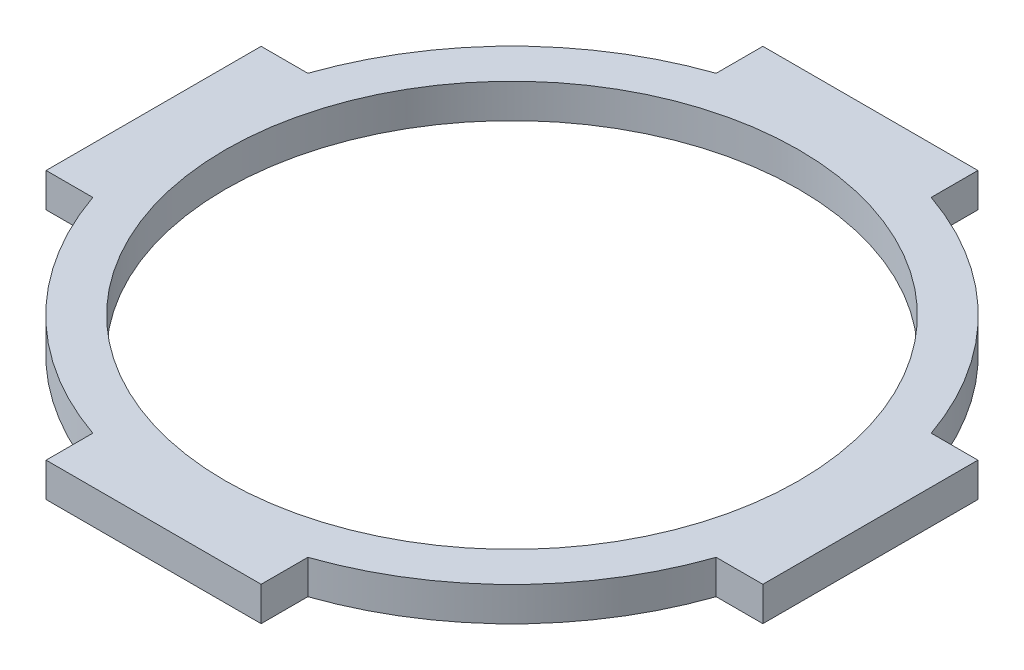
ISO-10303-21;
HEADER;
FILE_DESCRIPTION(('STEP AP214'),'2;1');
FILE_NAME('part.step','',(''),(''),'','','');
FILE_SCHEMA(('AUTOMOTIVE_DESIGN { 1 0 10303 214 1 1 1 1 }'));
ENDSEC;
DATA;
#1=APPLICATION_CONTEXT('core data for automotive mechanical design processes');
#2=APPLICATION_PROTOCOL_DEFINITION('international standard','automotive_design',2000,#1);
#3=PRODUCT_CONTEXT('',#1,'mechanical');
#4=PRODUCT('Part','Part','',(#3));
#5=PRODUCT_RELATED_PRODUCT_CATEGORY('part','',(#4));
#6=PRODUCT_DEFINITION_FORMATION('','',#4);
#7=PRODUCT_DEFINITION_CONTEXT('part definition',#1,'design');
#8=PRODUCT_DEFINITION('design','',#6,#7);
#9=PRODUCT_DEFINITION_SHAPE('','',#8);
#10=(LENGTH_UNIT() NAMED_UNIT(*) SI_UNIT(.MILLI.,.METRE.));
#11=(NAMED_UNIT(*) PLANE_ANGLE_UNIT() SI_UNIT($,.RADIAN.));
#12=(NAMED_UNIT(*) SI_UNIT($,.STERADIAN.) SOLID_ANGLE_UNIT());
#13=UNCERTAINTY_MEASURE_WITH_UNIT(LENGTH_MEASURE(1.E-05),#10,'distance_accuracy_value','');
#14=(GEOMETRIC_REPRESENTATION_CONTEXT(3) GLOBAL_UNCERTAINTY_ASSIGNED_CONTEXT((#13)) GLOBAL_UNIT_ASSIGNED_CONTEXT((#10,
#11,#12)) REPRESENTATION_CONTEXT('',''));
#15=CARTESIAN_POINT('',(0.,0.,0.));
#16=DIRECTION('',(0.,0.,1.));
#17=DIRECTION('',(1.,0.,0.));
#18=AXIS2_PLACEMENT_3D('',#15,#16,#17);
#19=CARTESIAN_POINT('',(0.,4.7625,0.));
#20=DIRECTION('',(0.,-1.,0.));
#21=DIRECTION('',(0.,0.,-1.));
#22=AXIS2_PLACEMENT_3D('',#19,#20,#21);
#23=CYLINDRICAL_SURFACE('',#22,46.);
#24=CARTESIAN_POINT('',(0.,4.7625,0.));
#25=DIRECTION('',(0.,1.,0.));
#26=DIRECTION('',(0.,0.,1.));
#27=AXIS2_PLACEMENT_3D('',#24,#25,#26);
#28=CIRCLE('',#27,46.);
#29=CARTESIAN_POINT('',(14.9999999999995,4.7625,43.485629810318));
#30=VERTEX_POINT('',#29);
#31=CARTESIAN_POINT('',(43.4856298103178,4.7625,15.));
#32=VERTEX_POINT('',#31);
#33=EDGE_CURVE('E43',#30,#32,#28,.T.);
#34=ORIENTED_EDGE('',*,*,#33,.F.);
#35=DIRECTION('',(0.,1.,0.));
#36=VECTOR('',#35,1.);
#37=CARTESIAN_POINT('',(14.9999999999995,-30.6991371046195,43.485629810318));
#38=LINE('',#37,#36);
#39=CARTESIAN_POINT('',(14.9999999999995,0.,43.485629810318));
#40=VERTEX_POINT('',#39);
#41=EDGE_CURVE('E178',#40,#30,#38,.T.);
#42=ORIENTED_EDGE('',*,*,#41,.F.);
#43=CARTESIAN_POINT('',(0.,0.,0.));
#44=DIRECTION('',(0.,1.,0.));
#45=DIRECTION('',(0.,0.,1.));
#46=AXIS2_PLACEMENT_3D('',#43,#44,#45);
#47=CIRCLE('',#46,46.);
#48=CARTESIAN_POINT('',(43.4856298103178,0.,15.));
#49=VERTEX_POINT('',#48);
#50=EDGE_CURVE('E315',#40,#49,#47,.T.);
#51=ORIENTED_EDGE('',*,*,#50,.T.);
#52=DIRECTION('',(0.,1.,0.));
#53=VECTOR('',#52,1.);
#54=CARTESIAN_POINT('',(43.4856298103178,-30.6991371046194,15.));
#55=LINE('',#54,#53);
#56=EDGE_CURVE('E199',#49,#32,#55,.T.);
#57=ORIENTED_EDGE('',*,*,#56,.T.);
#58=EDGE_LOOP('',(#34,#42,#51,#57));
#59=FACE_BOUND('',#58,.T.);
#60=ADVANCED_FACE('F34',(#59),#23,.T.);
#61=CARTESIAN_POINT('',(43.4856298103178,4.7625,-15.));
#62=VERTEX_POINT('',#61);
#63=CARTESIAN_POINT('',(15.0000000000002,4.7625,-43.4856298103177));
#64=VERTEX_POINT('',#63);
#65=EDGE_CURVE('E296',#62,#64,#28,.T.);
#66=ORIENTED_EDGE('',*,*,#65,.F.);
#67=DIRECTION('',(0.,1.,0.));
#68=VECTOR('',#67,1.);
#69=CARTESIAN_POINT('',(43.4856298103178,-30.6991371046194,-15.));
#70=LINE('',#69,#68);
#71=CARTESIAN_POINT('',(43.4856298103178,0.,-15.));
#72=VERTEX_POINT('',#71);
#73=EDGE_CURVE('E188',#72,#62,#70,.T.);
#74=ORIENTED_EDGE('',*,*,#73,.F.);
#75=CARTESIAN_POINT('',(15.0000000000002,0.,-43.4856298103177));
#76=VERTEX_POINT('',#75);
#77=EDGE_CURVE('E313',#72,#76,#47,.T.);
#78=ORIENTED_EDGE('',*,*,#77,.T.);
#79=DIRECTION('',(0.,1.,0.));
#80=VECTOR('',#79,1.);
#81=CARTESIAN_POINT('',(15.0000000000002,-30.6991371046194,-43.4856298103177));
#82=LINE('',#81,#80);
#83=EDGE_CURVE('E224',#76,#64,#82,.T.);
#84=ORIENTED_EDGE('',*,*,#83,.T.);
#85=EDGE_LOOP('',(#66,#74,#78,#84));
#86=FACE_BOUND('',#85,.T.);
#87=ADVANCED_FACE('F286',(#86),#23,.T.);
#88=CARTESIAN_POINT('',(-14.9999999999998,4.7625,-43.4856298103179));
#89=VERTEX_POINT('',#88);
#90=CARTESIAN_POINT('',(-43.4856298103178,4.7625,-15.));
#91=VERTEX_POINT('',#90);
#92=EDGE_CURVE('E44',#89,#91,#28,.T.);
#93=ORIENTED_EDGE('',*,*,#92,.F.);
#94=DIRECTION('',(0.,1.,0.));
#95=VECTOR('',#94,1.);
#96=CARTESIAN_POINT('',(-14.9999999999998,-30.6991371046194,-43.4856298103179));
#97=LINE('',#96,#95);
#98=CARTESIAN_POINT('',(-14.9999999999998,0.,-43.4856298103179));
#99=VERTEX_POINT('',#98);
#100=EDGE_CURVE('E213',#99,#89,#97,.T.);
#101=ORIENTED_EDGE('',*,*,#100,.F.);
#102=CARTESIAN_POINT('',(-43.4856298103178,0.,-15.));
#103=VERTEX_POINT('',#102);
#104=EDGE_CURVE('E264',#99,#103,#47,.T.);
#105=ORIENTED_EDGE('',*,*,#104,.T.);
#106=DIRECTION('',(0.,1.,0.));
#107=VECTOR('',#106,1.);
#108=CARTESIAN_POINT('',(-43.4856298103178,-30.6991371046194,-15.));
#109=LINE('',#108,#107);
#110=EDGE_CURVE('E249',#103,#91,#109,.T.);
#111=ORIENTED_EDGE('',*,*,#110,.T.);
#112=EDGE_LOOP('',(#93,#101,#105,#111));
#113=FACE_BOUND('',#112,.T.);
#114=ADVANCED_FACE('F282',(#113),#23,.T.);
#115=CARTESIAN_POINT('',(0.,4.7625,0.));
#116=DIRECTION('',(0.,1.,0.));
#117=DIRECTION('',(0.,0.,1.));
#118=AXIS2_PLACEMENT_3D('',#115,#116,#117);
#119=PLANE('',#118);
#120=CARTESIAN_POINT('',(-43.4856298103178,4.7625,15.));
#121=VERTEX_POINT('',#120);
#122=CARTESIAN_POINT('',(-15.0000000000005,4.7625,43.4856298103176));
#123=VERTEX_POINT('',#122);
#124=EDGE_CURVE('E11',#121,#123,#28,.T.);
#125=ORIENTED_EDGE('',*,*,#124,.T.);
#126=DIRECTION('',(0.,0.,1.));
#127=VECTOR('',#126,1.);
#128=CARTESIAN_POINT('',(-15.0000000000005,4.7625,43.4856298103176));
#129=LINE('',#128,#127);
#130=CARTESIAN_POINT('',(-15.0000000000005,4.7625,49.9999999999998));
#131=VERTEX_POINT('',#130);
#132=EDGE_CURVE('E153',#123,#131,#129,.T.);
#133=ORIENTED_EDGE('',*,*,#132,.T.);
#134=DIRECTION('',(1.,0.,0.));
#135=VECTOR('',#134,1.);
#136=CARTESIAN_POINT('',(-15.0000000000005,4.7625,49.9999999999998));
#137=LINE('',#136,#135);
#138=CARTESIAN_POINT('',(14.9999999999995,4.7625,50.0000000000002));
#139=VERTEX_POINT('',#138);
#140=EDGE_CURVE('E161',#131,#139,#137,.T.);
#141=ORIENTED_EDGE('',*,*,#140,.T.);
#142=DIRECTION('',(0.,0.,-1.));
#143=VECTOR('',#142,1.);
#144=CARTESIAN_POINT('',(14.9999999999995,4.7625,50.0000000000002));
#145=LINE('',#144,#143);
#146=EDGE_CURVE('E167',#139,#30,#145,.T.);
#147=ORIENTED_EDGE('',*,*,#146,.T.);
#148=ORIENTED_EDGE('',*,*,#33,.T.);
#149=DIRECTION('',(1.,0.,0.));
#150=VECTOR('',#149,1.);
#151=CARTESIAN_POINT('',(43.4856298103178,4.7625,15.));
#152=LINE('',#151,#150);
#153=CARTESIAN_POINT('',(50.,4.7625,15.));
#154=VERTEX_POINT('',#153);
#155=EDGE_CURVE('E184',#32,#154,#152,.T.);
#156=ORIENTED_EDGE('',*,*,#155,.T.);
#157=DIRECTION('',(0.,0.,-1.));
#158=VECTOR('',#157,1.);
#159=CARTESIAN_POINT('',(50.,4.7625,15.));
#160=LINE('',#159,#158);
#161=CARTESIAN_POINT('',(50.,4.7625,-15.));
#162=VERTEX_POINT('',#161);
#163=EDGE_CURVE('E193',#154,#162,#160,.T.);
#164=ORIENTED_EDGE('',*,*,#163,.T.);
#165=DIRECTION('',(-1.,0.,0.));
#166=VECTOR('',#165,1.);
#167=CARTESIAN_POINT('',(50.,4.7625,-15.));
#168=LINE('',#167,#166);
#169=EDGE_CURVE('E196',#162,#62,#168,.T.);
#170=ORIENTED_EDGE('',*,*,#169,.T.);
#171=ORIENTED_EDGE('',*,*,#65,.T.);
#172=DIRECTION('',(0.,0.,-1.));
#173=VECTOR('',#172,1.);
#174=CARTESIAN_POINT('',(15.0000000000002,4.7625,-43.4856298103177));
#175=LINE('',#174,#173);
#176=CARTESIAN_POINT('',(15.0000000000002,4.7625,-50.));
#177=VERTEX_POINT('',#176);
#178=EDGE_CURVE('E209',#64,#177,#175,.T.);
#179=ORIENTED_EDGE('',*,*,#178,.T.);
#180=DIRECTION('',(-1.,0.,0.));
#181=VECTOR('',#180,1.);
#182=CARTESIAN_POINT('',(15.0000000000002,4.7625,-50.));
#183=LINE('',#182,#181);
#184=CARTESIAN_POINT('',(-14.9999999999998,4.7625,-50.0000000000001));
#185=VERTEX_POINT('',#184);
#186=EDGE_CURVE('E218',#177,#185,#183,.T.);
#187=ORIENTED_EDGE('',*,*,#186,.T.);
#188=DIRECTION('',(0.,0.,1.));
#189=VECTOR('',#188,1.);
#190=CARTESIAN_POINT('',(-14.9999999999998,4.7625,-50.0000000000001));
#191=LINE('',#190,#189);
#192=EDGE_CURVE('E221',#185,#89,#191,.T.);
#193=ORIENTED_EDGE('',*,*,#192,.T.);
#194=ORIENTED_EDGE('',*,*,#92,.T.);
#195=DIRECTION('',(-1.,0.,0.));
#196=VECTOR('',#195,1.);
#197=CARTESIAN_POINT('',(-43.4856298103178,4.7625,-15.));
#198=LINE('',#197,#196);
#199=CARTESIAN_POINT('',(-50.,4.7625,-15.));
#200=VERTEX_POINT('',#199);
#201=EDGE_CURVE('E235',#91,#200,#198,.T.);
#202=ORIENTED_EDGE('',*,*,#201,.T.);
#203=DIRECTION('',(0.,0.,1.));
#204=VECTOR('',#203,1.);
#205=CARTESIAN_POINT('',(-50.,4.7625,-15.));
#206=LINE('',#205,#204);
#207=CARTESIAN_POINT('',(-50.,4.7625,15.));
#208=VERTEX_POINT('',#207);
#209=EDGE_CURVE('E244',#200,#208,#206,.T.);
#210=ORIENTED_EDGE('',*,*,#209,.T.);
#211=DIRECTION('',(1.,0.,0.));
#212=VECTOR('',#211,1.);
#213=CARTESIAN_POINT('',(-50.,4.7625,15.));
#214=LINE('',#213,#212);
#215=EDGE_CURVE('E247',#208,#121,#214,.T.);
#216=ORIENTED_EDGE('',*,*,#215,.T.);
#217=EDGE_LOOP('',(#125,#133,#141,#147,#148,#156,#164,#170,#171,#179,#187,#193,#194,#202,#210,#216));
#218=FACE_BOUND('',#217,.T.);
#219=CARTESIAN_POINT('',(0.,4.7625,0.));
#220=DIRECTION('',(0.,1.,0.));
#221=DIRECTION('',(0.,0.,1.));
#222=AXIS2_PLACEMENT_3D('',#219,#220,#221);
#223=CIRCLE('',#222,40.);
#224=CARTESIAN_POINT('',(0.,4.7625,40.));
#225=VERTEX_POINT('',#224);
#226=EDGE_CURVE('E261',#225,#225,#223,.T.);
#227=ORIENTED_EDGE('',*,*,#226,.F.);
#228=EDGE_LOOP('',(#227));
#229=FACE_BOUND('',#228,.T.);
#230=ADVANCED_FACE('F169',(#218,#229),#119,.T.);
#231=CARTESIAN_POINT('',(0.,0.,0.));
#232=DIRECTION('',(0.,1.,0.));
#233=DIRECTION('',(0.,0.,1.));
#234=AXIS2_PLACEMENT_3D('',#231,#232,#233);
#235=PLANE('',#234);
#236=CARTESIAN_POINT('',(-43.4856298103178,0.,15.));
#237=VERTEX_POINT('',#236);
#238=CARTESIAN_POINT('',(-15.0000000000005,0.,43.4856298103176));
#239=VERTEX_POINT('',#238);
#240=EDGE_CURVE('E38',#237,#239,#47,.T.);
#241=ORIENTED_EDGE('',*,*,#240,.F.);
#242=DIRECTION('',(-1.,0.,0.));
#243=VECTOR('',#242,1.);
#244=CARTESIAN_POINT('',(-50.,0.,15.));
#245=LINE('',#244,#243);
#246=CARTESIAN_POINT('',(-50.,0.,15.));
#247=VERTEX_POINT('',#246);
#248=EDGE_CURVE('E238',#237,#247,#245,.T.);
#249=ORIENTED_EDGE('',*,*,#248,.T.);
#250=DIRECTION('',(0.,0.,-1.));
#251=VECTOR('',#250,1.);
#252=CARTESIAN_POINT('',(-50.,0.,-15.));
#253=LINE('',#252,#251);
#254=CARTESIAN_POINT('',(-50.,0.,-15.));
#255=VERTEX_POINT('',#254);
#256=EDGE_CURVE('E236',#247,#255,#253,.T.);
#257=ORIENTED_EDGE('',*,*,#256,.T.);
#258=DIRECTION('',(1.,0.,0.));
#259=VECTOR('',#258,1.);
#260=CARTESIAN_POINT('',(-43.4856298103178,0.,-15.));
#261=LINE('',#260,#259);
#262=EDGE_CURVE('E241',#255,#103,#261,.T.);
#263=ORIENTED_EDGE('',*,*,#262,.T.);
#264=ORIENTED_EDGE('',*,*,#104,.F.);
#265=DIRECTION('',(0.,0.,-1.));
#266=VECTOR('',#265,1.);
#267=CARTESIAN_POINT('',(-14.9999999999998,0.,-50.0000000000001));
#268=LINE('',#267,#266);
#269=CARTESIAN_POINT('',(-14.9999999999998,0.,-50.));
#270=VERTEX_POINT('',#269);
#271=EDGE_CURVE('E212',#99,#270,#268,.T.);
#272=ORIENTED_EDGE('',*,*,#271,.T.);
#273=DIRECTION('',(1.,0.,0.));
#274=VECTOR('',#273,1.);
#275=CARTESIAN_POINT('',(15.0000000000002,0.,-50.));
#276=LINE('',#275,#274);
#277=CARTESIAN_POINT('',(15.0000000000002,0.,-50.));
#278=VERTEX_POINT('',#277);
#279=EDGE_CURVE('E210',#270,#278,#276,.T.);
#280=ORIENTED_EDGE('',*,*,#279,.T.);
#281=DIRECTION('',(0.,0.,1.));
#282=VECTOR('',#281,1.);
#283=CARTESIAN_POINT('',(15.0000000000002,0.,-43.4856298103177));
#284=LINE('',#283,#282);
#285=EDGE_CURVE('E215',#278,#76,#284,.T.);
#286=ORIENTED_EDGE('',*,*,#285,.T.);
#287=ORIENTED_EDGE('',*,*,#77,.F.);
#288=DIRECTION('',(1.,0.,0.));
#289=VECTOR('',#288,1.);
#290=CARTESIAN_POINT('',(50.,0.,-15.));
#291=LINE('',#290,#289);
#292=CARTESIAN_POINT('',(50.,0.,-15.));
#293=VERTEX_POINT('',#292);
#294=EDGE_CURVE('E187',#72,#293,#291,.T.);
#295=ORIENTED_EDGE('',*,*,#294,.T.);
#296=DIRECTION('',(0.,0.,1.));
#297=VECTOR('',#296,1.);
#298=CARTESIAN_POINT('',(50.,0.,15.));
#299=LINE('',#298,#297);
#300=CARTESIAN_POINT('',(50.,0.,15.));
#301=VERTEX_POINT('',#300);
#302=EDGE_CURVE('E185',#293,#301,#299,.T.);
#303=ORIENTED_EDGE('',*,*,#302,.T.);
#304=DIRECTION('',(-1.,0.,0.));
#305=VECTOR('',#304,1.);
#306=CARTESIAN_POINT('',(43.4856298103178,0.,15.));
#307=LINE('',#306,#305);
#308=EDGE_CURVE('E190',#301,#49,#307,.T.);
#309=ORIENTED_EDGE('',*,*,#308,.T.);
#310=ORIENTED_EDGE('',*,*,#50,.F.);
#311=DIRECTION('',(0.,0.,1.));
#312=VECTOR('',#311,1.);
#313=CARTESIAN_POINT('',(14.9999999999995,0.,50.0000000000002));
#314=LINE('',#313,#312);
#315=CARTESIAN_POINT('',(14.9999999999995,0.,50.0000000000002));
#316=VERTEX_POINT('',#315);
#317=EDGE_CURVE('E174',#40,#316,#314,.T.);
#318=ORIENTED_EDGE('',*,*,#317,.T.);
#319=DIRECTION('',(-1.,0.,0.));
#320=VECTOR('',#319,1.);
#321=CARTESIAN_POINT('',(-15.0000000000005,0.,49.9999999999998));
#322=LINE('',#321,#320);
#323=CARTESIAN_POINT('',(-15.0000000000005,0.,49.9999999999998));
#324=VERTEX_POINT('',#323);
#325=EDGE_CURVE('E180',#316,#324,#322,.T.);
#326=ORIENTED_EDGE('',*,*,#325,.T.);
#327=DIRECTION('',(0.,0.,-1.));
#328=VECTOR('',#327,1.);
#329=CARTESIAN_POINT('',(-15.0000000000005,0.,43.4856298103176));
#330=LINE('',#329,#328);
#331=EDGE_CURVE('E155',#324,#239,#330,.T.);
#332=ORIENTED_EDGE('',*,*,#331,.T.);
#333=EDGE_LOOP('',(#241,#249,#257,#263,#264,#272,#280,#286,#287,#295,#303,#309,#310,#318,#326,#332));
#334=FACE_BOUND('',#333,.T.);
#335=CARTESIAN_POINT('',(0.,0.,0.));
#336=DIRECTION('',(0.,1.,0.));
#337=DIRECTION('',(0.,0.,1.));
#338=AXIS2_PLACEMENT_3D('',#335,#336,#337);
#339=CIRCLE('',#338,40.);
#340=CARTESIAN_POINT('',(0.,0.,40.));
#341=VERTEX_POINT('',#340);
#342=EDGE_CURVE('E260',#341,#341,#339,.T.);
#343=ORIENTED_EDGE('',*,*,#342,.T.);
#344=EDGE_LOOP('',(#343));
#345=FACE_BOUND('',#344,.T.);
#346=ADVANCED_FACE('F268',(#334,#345),#235,.F.);
#347=ORIENTED_EDGE('',*,*,#240,.T.);
#348=DIRECTION('',(0.,1.,0.));
#349=VECTOR('',#348,1.);
#350=CARTESIAN_POINT('',(-15.0000000000005,-30.6991371046195,43.4856298103176));
#351=LINE('',#350,#349);
#352=EDGE_CURVE('E58',#239,#123,#351,.T.);
#353=ORIENTED_EDGE('',*,*,#352,.T.);
#354=ORIENTED_EDGE('',*,*,#124,.F.);
#355=DIRECTION('',(0.,1.,0.));
#356=VECTOR('',#355,1.);
#357=CARTESIAN_POINT('',(-43.4856298103178,-30.6991371046194,15.));
#358=LINE('',#357,#356);
#359=EDGE_CURVE('E239',#237,#121,#358,.T.);
#360=ORIENTED_EDGE('',*,*,#359,.F.);
#361=EDGE_LOOP('',(#347,#353,#354,#360));
#362=FACE_BOUND('',#361,.T.);
#363=ADVANCED_FACE('F36',(#362),#23,.T.);
#364=CARTESIAN_POINT('',(0.,4.7625,0.));
#365=DIRECTION('',(0.,-1.,0.));
#366=DIRECTION('',(0.,0.,-1.));
#367=AXIS2_PLACEMENT_3D('',#364,#365,#366);
#368=CYLINDRICAL_SURFACE('',#367,40.);
#369=ORIENTED_EDGE('',*,*,#226,.T.);
#370=EDGE_LOOP('',(#369));
#371=FACE_BOUND('',#370,.T.);
#372=ORIENTED_EDGE('',*,*,#342,.F.);
#373=EDGE_LOOP('',(#372));
#374=FACE_BOUND('',#373,.T.);
#375=ADVANCED_FACE('F270',(#371,#374),#368,.F.);
#376=CARTESIAN_POINT('',(-50.,-30.6991371046194,15.));
#377=DIRECTION('',(0.,0.,1.));
#378=DIRECTION('',(1.,0.,0.));
#379=AXIS2_PLACEMENT_3D('',#376,#377,#378);
#380=PLANE('',#379);
#381=ORIENTED_EDGE('',*,*,#248,.F.);
#382=ORIENTED_EDGE('',*,*,#359,.T.);
#383=ORIENTED_EDGE('',*,*,#215,.F.);
#384=DIRECTION('',(0.,1.,0.));
#385=VECTOR('',#384,1.);
#386=CARTESIAN_POINT('',(-50.,-30.6991371046194,15.));
#387=LINE('',#386,#385);
#388=EDGE_CURVE('E252',#247,#208,#387,.T.);
#389=ORIENTED_EDGE('',*,*,#388,.F.);
#390=EDGE_LOOP('',(#381,#382,#383,#389));
#391=FACE_BOUND('',#390,.T.);
#392=ADVANCED_FACE('F272',(#391),#380,.T.);
#393=CARTESIAN_POINT('',(-50.,-30.6991371046194,-15.));
#394=DIRECTION('',(-1.,0.,0.));
#395=DIRECTION('',(0.,0.,1.));
#396=AXIS2_PLACEMENT_3D('',#393,#394,#395);
#397=PLANE('',#396);
#398=ORIENTED_EDGE('',*,*,#256,.F.);
#399=ORIENTED_EDGE('',*,*,#388,.T.);
#400=ORIENTED_EDGE('',*,*,#209,.F.);
#401=DIRECTION('',(0.,1.,0.));
#402=VECTOR('',#401,1.);
#403=CARTESIAN_POINT('',(-50.,-30.6991371046194,-15.));
#404=LINE('',#403,#402);
#405=EDGE_CURVE('E254',#255,#200,#404,.T.);
#406=ORIENTED_EDGE('',*,*,#405,.F.);
#407=EDGE_LOOP('',(#398,#399,#400,#406));
#408=FACE_BOUND('',#407,.T.);
#409=ADVANCED_FACE('F279',(#408),#397,.T.);
#410=CARTESIAN_POINT('',(-43.4856298103178,-30.6991371046194,-15.));
#411=DIRECTION('',(0.,0.,-1.));
#412=DIRECTION('',(-1.,0.,0.));
#413=AXIS2_PLACEMENT_3D('',#410,#411,#412);
#414=PLANE('',#413);
#415=ORIENTED_EDGE('',*,*,#262,.F.);
#416=ORIENTED_EDGE('',*,*,#405,.T.);
#417=ORIENTED_EDGE('',*,*,#201,.F.);
#418=ORIENTED_EDGE('',*,*,#110,.F.);
#419=EDGE_LOOP('',(#415,#416,#417,#418));
#420=FACE_BOUND('',#419,.T.);
#421=ADVANCED_FACE('F323',(#420),#414,.T.);
#422=CARTESIAN_POINT('',(-14.9999999999998,-30.6991371046194,-50.0000000000001));
#423=DIRECTION('',(-1.,0.,0.));
#424=DIRECTION('',(0.,0.,1.));
#425=AXIS2_PLACEMENT_3D('',#422,#423,#424);
#426=PLANE('',#425);
#427=ORIENTED_EDGE('',*,*,#271,.F.);
#428=ORIENTED_EDGE('',*,*,#100,.T.);
#429=ORIENTED_EDGE('',*,*,#192,.F.);
#430=DIRECTION('',(0.,1.,0.));
#431=VECTOR('',#430,1.);
#432=CARTESIAN_POINT('',(-14.9999999999998,-30.6991371046194,-50.0000000000001));
#433=LINE('',#432,#431);
#434=EDGE_CURVE('E227',#270,#185,#433,.T.);
#435=ORIENTED_EDGE('',*,*,#434,.F.);
#436=EDGE_LOOP('',(#427,#428,#429,#435));
#437=FACE_BOUND('',#436,.T.);
#438=ADVANCED_FACE('F346',(#437),#426,.T.);
#439=CARTESIAN_POINT('',(15.0000000000002,-30.6991371046194,-50.));
#440=DIRECTION('',(0.,0.,-1.));
#441=DIRECTION('',(-1.,0.,0.));
#442=AXIS2_PLACEMENT_3D('',#439,#440,#441);
#443=PLANE('',#442);
#444=ORIENTED_EDGE('',*,*,#279,.F.);
#445=ORIENTED_EDGE('',*,*,#434,.T.);
#446=ORIENTED_EDGE('',*,*,#186,.F.);
#447=DIRECTION('',(0.,1.,0.));
#448=VECTOR('',#447,1.);
#449=CARTESIAN_POINT('',(15.0000000000002,-30.6991371046194,-50.));
#450=LINE('',#449,#448);
#451=EDGE_CURVE('E229',#278,#177,#450,.T.);
#452=ORIENTED_EDGE('',*,*,#451,.F.);
#453=EDGE_LOOP('',(#444,#445,#446,#452));
#454=FACE_BOUND('',#453,.T.);
#455=ADVANCED_FACE('F349',(#454),#443,.T.);
#456=CARTESIAN_POINT('',(15.0000000000002,-30.6991371046194,-43.4856298103177));
#457=DIRECTION('',(1.,0.,0.));
#458=DIRECTION('',(0.,0.,-1.));
#459=AXIS2_PLACEMENT_3D('',#456,#457,#458);
#460=PLANE('',#459);
#461=ORIENTED_EDGE('',*,*,#285,.F.);
#462=ORIENTED_EDGE('',*,*,#451,.T.);
#463=ORIENTED_EDGE('',*,*,#178,.F.);
#464=ORIENTED_EDGE('',*,*,#83,.F.);
#465=EDGE_LOOP('',(#461,#462,#463,#464));
#466=FACE_BOUND('',#465,.T.);
#467=ADVANCED_FACE('F353',(#466),#460,.T.);
#468=CARTESIAN_POINT('',(50.,-30.6991371046194,-15.));
#469=DIRECTION('',(0.,0.,-1.));
#470=DIRECTION('',(-1.,0.,0.));
#471=AXIS2_PLACEMENT_3D('',#468,#469,#470);
#472=PLANE('',#471);
#473=ORIENTED_EDGE('',*,*,#294,.F.);
#474=ORIENTED_EDGE('',*,*,#73,.T.);
#475=ORIENTED_EDGE('',*,*,#169,.F.);
#476=DIRECTION('',(0.,1.,0.));
#477=VECTOR('',#476,1.);
#478=CARTESIAN_POINT('',(50.,-30.6991371046194,-15.));
#479=LINE('',#478,#477);
#480=EDGE_CURVE('E202',#293,#162,#479,.T.);
#481=ORIENTED_EDGE('',*,*,#480,.F.);
#482=EDGE_LOOP('',(#473,#474,#475,#481));
#483=FACE_BOUND('',#482,.T.);
#484=ADVANCED_FACE('F302',(#483),#472,.T.);
#485=CARTESIAN_POINT('',(50.,-30.6991371046194,15.));
#486=DIRECTION('',(1.,0.,0.));
#487=DIRECTION('',(0.,0.,-1.));
#488=AXIS2_PLACEMENT_3D('',#485,#486,#487);
#489=PLANE('',#488);
#490=ORIENTED_EDGE('',*,*,#302,.F.);
#491=ORIENTED_EDGE('',*,*,#480,.T.);
#492=ORIENTED_EDGE('',*,*,#163,.F.);
#493=DIRECTION('',(0.,1.,0.));
#494=VECTOR('',#493,1.);
#495=CARTESIAN_POINT('',(50.,-30.6991371046194,15.));
#496=LINE('',#495,#494);
#497=EDGE_CURVE('E204',#301,#154,#496,.T.);
#498=ORIENTED_EDGE('',*,*,#497,.F.);
#499=EDGE_LOOP('',(#490,#491,#492,#498));
#500=FACE_BOUND('',#499,.T.);
#501=ADVANCED_FACE('F309',(#500),#489,.T.);
#502=CARTESIAN_POINT('',(43.4856298103178,-30.6991371046194,15.));
#503=DIRECTION('',(0.,0.,1.));
#504=DIRECTION('',(1.,0.,0.));
#505=AXIS2_PLACEMENT_3D('',#502,#503,#504);
#506=PLANE('',#505);
#507=ORIENTED_EDGE('',*,*,#308,.F.);
#508=ORIENTED_EDGE('',*,*,#497,.T.);
#509=ORIENTED_EDGE('',*,*,#155,.F.);
#510=ORIENTED_EDGE('',*,*,#56,.F.);
#511=EDGE_LOOP('',(#507,#508,#509,#510));
#512=FACE_BOUND('',#511,.T.);
#513=ADVANCED_FACE('F335',(#512),#506,.T.);
#514=CARTESIAN_POINT('',(14.9999999999995,-30.6991371046195,50.0000000000002));
#515=DIRECTION('',(1.,0.,0.));
#516=DIRECTION('',(0.,0.,-1.));
#517=AXIS2_PLACEMENT_3D('',#514,#515,#516);
#518=PLANE('',#517);
#519=ORIENTED_EDGE('',*,*,#317,.F.);
#520=ORIENTED_EDGE('',*,*,#41,.T.);
#521=ORIENTED_EDGE('',*,*,#146,.F.);
#522=DIRECTION('',(0.,1.,0.));
#523=VECTOR('',#522,1.);
#524=CARTESIAN_POINT('',(14.9999999999995,-30.6991371046195,50.0000000000002));
#525=LINE('',#524,#523);
#526=EDGE_CURVE('E158',#316,#139,#525,.T.);
#527=ORIENTED_EDGE('',*,*,#526,.F.);
#528=EDGE_LOOP('',(#519,#520,#521,#527));
#529=FACE_BOUND('',#528,.T.);
#530=ADVANCED_FACE('F333',(#529),#518,.T.);
#531=CARTESIAN_POINT('',(-15.0000000000005,-30.6991371046195,49.9999999999998));
#532=DIRECTION('',(0.,0.,1.));
#533=DIRECTION('',(1.,0.,0.));
#534=AXIS2_PLACEMENT_3D('',#531,#532,#533);
#535=PLANE('',#534);
#536=ORIENTED_EDGE('',*,*,#325,.F.);
#537=ORIENTED_EDGE('',*,*,#526,.T.);
#538=ORIENTED_EDGE('',*,*,#140,.F.);
#539=DIRECTION('',(0.,1.,0.));
#540=VECTOR('',#539,1.);
#541=CARTESIAN_POINT('',(-15.0000000000005,-30.6991371046195,49.9999999999998));
#542=LINE('',#541,#540);
#543=EDGE_CURVE('E149',#324,#131,#542,.T.);
#544=ORIENTED_EDGE('',*,*,#543,.F.);
#545=EDGE_LOOP('',(#536,#537,#538,#544));
#546=FACE_BOUND('',#545,.T.);
#547=ADVANCED_FACE('F162',(#546),#535,.T.);
#548=CARTESIAN_POINT('',(-15.0000000000005,-30.6991371046195,43.4856298103176));
#549=DIRECTION('',(-1.,0.,0.));
#550=DIRECTION('',(0.,0.,1.));
#551=AXIS2_PLACEMENT_3D('',#548,#549,#550);
#552=PLANE('',#551);
#553=ORIENTED_EDGE('',*,*,#331,.F.);
#554=ORIENTED_EDGE('',*,*,#543,.T.);
#555=ORIENTED_EDGE('',*,*,#132,.F.);
#556=ORIENTED_EDGE('',*,*,#352,.F.);
#557=EDGE_LOOP('',(#553,#554,#555,#556));
#558=FACE_BOUND('',#557,.T.);
#559=ADVANCED_FACE('F151',(#558),#552,.T.);
#560=CLOSED_SHELL('',(#60,#87,#114,#230,#346,#363,#375,#392,#409,#421,#438,#455,#467,#484,#501,
#513,#530,#547,#559));
#561=MANIFOLD_SOLID_BREP('B2',#560);
#562=ADVANCED_BREP_SHAPE_REPRESENTATION('',(#18,#561),#14);
#563=SHAPE_DEFINITION_REPRESENTATION(#9,#562);
ENDSEC;
END-ISO-10303-21;
